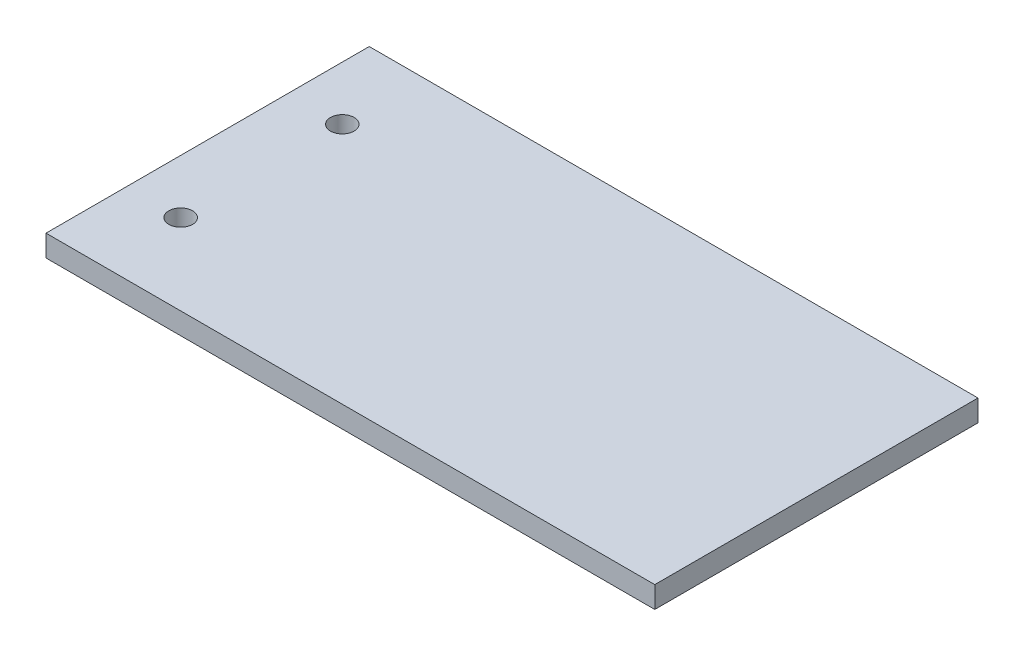
ISO-10303-21;
HEADER;
FILE_DESCRIPTION(('STEP AP214'),'2;1');
FILE_NAME('part.step','',(''),(''),'','','');
FILE_SCHEMA(('AUTOMOTIVE_DESIGN { 1 0 10303 214 1 1 1 1 }'));
ENDSEC;
DATA;
#1=APPLICATION_CONTEXT('core data for automotive mechanical design processes');
#2=APPLICATION_PROTOCOL_DEFINITION('international standard','automotive_design',2000,#1);
#3=PRODUCT_CONTEXT('',#1,'mechanical');
#4=PRODUCT('Part','Part','',(#3));
#5=PRODUCT_RELATED_PRODUCT_CATEGORY('part','',(#4));
#6=PRODUCT_DEFINITION_FORMATION('','',#4);
#7=PRODUCT_DEFINITION_CONTEXT('part definition',#1,'design');
#8=PRODUCT_DEFINITION('design','',#6,#7);
#9=PRODUCT_DEFINITION_SHAPE('','',#8);
#10=(LENGTH_UNIT() NAMED_UNIT(*) SI_UNIT(.MILLI.,.METRE.));
#11=(NAMED_UNIT(*) PLANE_ANGLE_UNIT() SI_UNIT($,.RADIAN.));
#12=(NAMED_UNIT(*) SI_UNIT($,.STERADIAN.) SOLID_ANGLE_UNIT());
#13=UNCERTAINTY_MEASURE_WITH_UNIT(LENGTH_MEASURE(1.E-05),#10,'distance_accuracy_value','');
#14=(GEOMETRIC_REPRESENTATION_CONTEXT(3) GLOBAL_UNCERTAINTY_ASSIGNED_CONTEXT((#13)) GLOBAL_UNIT_ASSIGNED_CONTEXT((#10,
#11,#12)) REPRESENTATION_CONTEXT('',''));
#15=CARTESIAN_POINT('',(0.,0.,0.));
#16=DIRECTION('',(0.,0.,1.));
#17=DIRECTION('',(1.,0.,0.));
#18=AXIS2_PLACEMENT_3D('',#15,#16,#17);
#19=CARTESIAN_POINT('',(0.,4.,0.));
#20=DIRECTION('',(0.,1.,0.));
#21=DIRECTION('',(0.,0.,1.));
#22=AXIS2_PLACEMENT_3D('',#19,#20,#21);
#23=PLANE('',#22);
#24=CARTESIAN_POINT('',(10.,4.,15.));
#25=DIRECTION('',(0.,1.,0.));
#26=DIRECTION('',(0.,0.,1.));
#27=AXIS2_PLACEMENT_3D('',#24,#25,#26);
#28=CIRCLE('',#27,2.2);
#29=CARTESIAN_POINT('',(10.,4.,17.2));
#30=VERTEX_POINT('',#29);
#31=EDGE_CURVE('E103',#30,#30,#28,.T.);
#32=ORIENTED_EDGE('',*,*,#31,.F.);
#33=EDGE_LOOP('',(#32));
#34=FACE_BOUND('',#33,.T.);
#35=DIRECTION('',(0.,0.,1.));
#36=VECTOR('',#35,1.);
#37=CARTESIAN_POINT('',(0.,4.,-30.));
#38=LINE('',#37,#36);
#39=CARTESIAN_POINT('',(0.,4.,-30.));
#40=VERTEX_POINT('',#39);
#41=CARTESIAN_POINT('',(0.,4.,30.));
#42=VERTEX_POINT('',#41);
#43=EDGE_CURVE('E88',#40,#42,#38,.T.);
#44=ORIENTED_EDGE('',*,*,#43,.T.);
#45=DIRECTION('',(1.,0.,0.));
#46=VECTOR('',#45,1.);
#47=CARTESIAN_POINT('',(0.,4.,30.));
#48=LINE('',#47,#46);
#49=CARTESIAN_POINT('',(113.,4.,30.));
#50=VERTEX_POINT('',#49);
#51=EDGE_CURVE('E83',#42,#50,#48,.T.);
#52=ORIENTED_EDGE('',*,*,#51,.T.);
#53=DIRECTION('',(0.,0.,-1.));
#54=VECTOR('',#53,1.);
#55=CARTESIAN_POINT('',(113.,4.,-30.));
#56=LINE('',#55,#54);
#57=CARTESIAN_POINT('',(113.,4.,-30.));
#58=VERTEX_POINT('',#57);
#59=EDGE_CURVE('E86',#50,#58,#56,.T.);
#60=ORIENTED_EDGE('',*,*,#59,.T.);
#61=DIRECTION('',(-1.,0.,0.));
#62=VECTOR('',#61,1.);
#63=CARTESIAN_POINT('',(0.,4.,-30.));
#64=LINE('',#63,#62);
#65=EDGE_CURVE('E53',#58,#40,#64,.T.);
#66=ORIENTED_EDGE('',*,*,#65,.T.);
#67=EDGE_LOOP('',(#44,#52,#60,#66));
#68=FACE_BOUND('',#67,.T.);
#69=CARTESIAN_POINT('',(10.,4.,-15.));
#70=DIRECTION('',(0.,1.,0.));
#71=DIRECTION('',(0.,0.,1.));
#72=AXIS2_PLACEMENT_3D('',#69,#70,#71);
#73=CIRCLE('',#72,2.2);
#74=CARTESIAN_POINT('',(10.,4.,-12.8));
#75=VERTEX_POINT('',#74);
#76=EDGE_CURVE('E118',#75,#75,#73,.T.);
#77=ORIENTED_EDGE('',*,*,#76,.F.);
#78=EDGE_LOOP('',(#77));
#79=FACE_BOUND('',#78,.T.);
#80=ADVANCED_FACE('F36',(#34,#68,#79),#23,.T.);
#81=CARTESIAN_POINT('',(0.,0.,0.));
#82=DIRECTION('',(0.,1.,0.));
#83=DIRECTION('',(0.,0.,1.));
#84=AXIS2_PLACEMENT_3D('',#81,#82,#83);
#85=PLANE('',#84);
#86=DIRECTION('',(0.,0.,1.));
#87=VECTOR('',#86,1.);
#88=CARTESIAN_POINT('',(0.,0.,-30.));
#89=LINE('',#88,#87);
#90=CARTESIAN_POINT('',(0.,0.,-30.));
#91=VERTEX_POINT('',#90);
#92=CARTESIAN_POINT('',(0.,0.,30.));
#93=VERTEX_POINT('',#92);
#94=EDGE_CURVE('E100',#91,#93,#89,.T.);
#95=ORIENTED_EDGE('',*,*,#94,.F.);
#96=DIRECTION('',(-1.,0.,0.));
#97=VECTOR('',#96,1.);
#98=CARTESIAN_POINT('',(0.,0.,-30.));
#99=LINE('',#98,#97);
#100=CARTESIAN_POINT('',(113.,0.,-30.));
#101=VERTEX_POINT('',#100);
#102=EDGE_CURVE('E76',#101,#91,#99,.T.);
#103=ORIENTED_EDGE('',*,*,#102,.F.);
#104=DIRECTION('',(0.,0.,-1.));
#105=VECTOR('',#104,1.);
#106=CARTESIAN_POINT('',(113.,0.,-30.));
#107=LINE('',#106,#105);
#108=CARTESIAN_POINT('',(113.,0.,30.));
#109=VERTEX_POINT('',#108);
#110=EDGE_CURVE('E70',#109,#101,#107,.T.);
#111=ORIENTED_EDGE('',*,*,#110,.F.);
#112=DIRECTION('',(1.,0.,0.));
#113=VECTOR('',#112,1.);
#114=CARTESIAN_POINT('',(0.,0.,30.));
#115=LINE('',#114,#113);
#116=EDGE_CURVE('E92',#93,#109,#115,.T.);
#117=ORIENTED_EDGE('',*,*,#116,.F.);
#118=EDGE_LOOP('',(#95,#103,#111,#117));
#119=FACE_BOUND('',#118,.T.);
#120=CARTESIAN_POINT('',(10.,0.,15.));
#121=DIRECTION('',(0.,1.,0.));
#122=DIRECTION('',(0.,0.,1.));
#123=AXIS2_PLACEMENT_3D('',#120,#121,#122);
#124=CIRCLE('',#123,2.2);
#125=CARTESIAN_POINT('',(10.,0.,17.2));
#126=VERTEX_POINT('',#125);
#127=EDGE_CURVE('E115',#126,#126,#124,.T.);
#128=ORIENTED_EDGE('',*,*,#127,.T.);
#129=EDGE_LOOP('',(#128));
#130=FACE_BOUND('',#129,.T.);
#131=CARTESIAN_POINT('',(10.,0.,-15.));
#132=DIRECTION('',(0.,1.,0.));
#133=DIRECTION('',(0.,0.,1.));
#134=AXIS2_PLACEMENT_3D('',#131,#132,#133);
#135=CIRCLE('',#134,2.2);
#136=CARTESIAN_POINT('',(10.,0.,-12.8));
#137=VERTEX_POINT('',#136);
#138=EDGE_CURVE('E121',#137,#137,#135,.T.);
#139=ORIENTED_EDGE('',*,*,#138,.T.);
#140=EDGE_LOOP('',(#139));
#141=FACE_BOUND('',#140,.T.);
#142=ADVANCED_FACE('F111',(#119,#130,#141),#85,.F.);
#143=CARTESIAN_POINT('',(0.,4.,-30.));
#144=DIRECTION('',(1.,0.,0.));
#145=DIRECTION('',(0.,0.,-1.));
#146=AXIS2_PLACEMENT_3D('',#143,#144,#145);
#147=PLANE('',#146);
#148=ORIENTED_EDGE('',*,*,#94,.T.);
#149=DIRECTION('',(0.,-1.,0.));
#150=VECTOR('',#149,1.);
#151=CARTESIAN_POINT('',(0.,4.,30.));
#152=LINE('',#151,#150);
#153=EDGE_CURVE('E11',#42,#93,#152,.T.);
#154=ORIENTED_EDGE('',*,*,#153,.F.);
#155=ORIENTED_EDGE('',*,*,#43,.F.);
#156=DIRECTION('',(0.,-1.,0.));
#157=VECTOR('',#156,1.);
#158=CARTESIAN_POINT('',(0.,4.,-30.));
#159=LINE('',#158,#157);
#160=EDGE_CURVE('E96',#40,#91,#159,.T.);
#161=ORIENTED_EDGE('',*,*,#160,.T.);
#162=EDGE_LOOP('',(#148,#154,#155,#161));
#163=FACE_BOUND('',#162,.T.);
#164=ADVANCED_FACE('F38',(#163),#147,.F.);
#165=CARTESIAN_POINT('',(0.,4.,30.));
#166=DIRECTION('',(0.,0.,-1.));
#167=DIRECTION('',(-1.,0.,0.));
#168=AXIS2_PLACEMENT_3D('',#165,#166,#167);
#169=PLANE('',#168);
#170=ORIENTED_EDGE('',*,*,#116,.T.);
#171=DIRECTION('',(0.,-1.,0.));
#172=VECTOR('',#171,1.);
#173=CARTESIAN_POINT('',(113.,4.,30.));
#174=LINE('',#173,#172);
#175=EDGE_CURVE('E45',#50,#109,#174,.T.);
#176=ORIENTED_EDGE('',*,*,#175,.F.);
#177=ORIENTED_EDGE('',*,*,#51,.F.);
#178=ORIENTED_EDGE('',*,*,#153,.T.);
#179=EDGE_LOOP('',(#170,#176,#177,#178));
#180=FACE_BOUND('',#179,.T.);
#181=ADVANCED_FACE('F91',(#180),#169,.F.);
#182=CARTESIAN_POINT('',(113.,4.,-30.));
#183=DIRECTION('',(-1.,0.,0.));
#184=DIRECTION('',(0.,0.,1.));
#185=AXIS2_PLACEMENT_3D('',#182,#183,#184);
#186=PLANE('',#185);
#187=ORIENTED_EDGE('',*,*,#110,.T.);
#188=DIRECTION('',(0.,-1.,0.));
#189=VECTOR('',#188,1.);
#190=CARTESIAN_POINT('',(113.,4.,-30.));
#191=LINE('',#190,#189);
#192=EDGE_CURVE('E93',#58,#101,#191,.T.);
#193=ORIENTED_EDGE('',*,*,#192,.F.);
#194=ORIENTED_EDGE('',*,*,#59,.F.);
#195=ORIENTED_EDGE('',*,*,#175,.T.);
#196=EDGE_LOOP('',(#187,#193,#194,#195));
#197=FACE_BOUND('',#196,.T.);
#198=ADVANCED_FACE('F94',(#197),#186,.F.);
#199=CARTESIAN_POINT('',(0.,4.,-30.));
#200=DIRECTION('',(0.,0.,1.));
#201=DIRECTION('',(1.,0.,0.));
#202=AXIS2_PLACEMENT_3D('',#199,#200,#201);
#203=PLANE('',#202);
#204=ORIENTED_EDGE('',*,*,#102,.T.);
#205=ORIENTED_EDGE('',*,*,#160,.F.);
#206=ORIENTED_EDGE('',*,*,#65,.F.);
#207=ORIENTED_EDGE('',*,*,#192,.T.);
#208=EDGE_LOOP('',(#204,#205,#206,#207));
#209=FACE_BOUND('',#208,.T.);
#210=ADVANCED_FACE('F108',(#209),#203,.F.);
#211=CARTESIAN_POINT('',(10.,4.,15.));
#212=DIRECTION('',(0.,-1.,0.));
#213=DIRECTION('',(0.,0.,-1.));
#214=AXIS2_PLACEMENT_3D('',#211,#212,#213);
#215=CYLINDRICAL_SURFACE('',#214,2.2);
#216=ORIENTED_EDGE('',*,*,#31,.T.);
#217=EDGE_LOOP('',(#216));
#218=FACE_BOUND('',#217,.T.);
#219=ORIENTED_EDGE('',*,*,#127,.F.);
#220=EDGE_LOOP('',(#219));
#221=FACE_BOUND('',#220,.T.);
#222=ADVANCED_FACE('F138',(#218,#221),#215,.F.);
#223=CARTESIAN_POINT('',(10.,4.,-15.));
#224=DIRECTION('',(0.,-1.,0.));
#225=DIRECTION('',(0.,0.,-1.));
#226=AXIS2_PLACEMENT_3D('',#223,#224,#225);
#227=CYLINDRICAL_SURFACE('',#226,2.2);
#228=ORIENTED_EDGE('',*,*,#76,.T.);
#229=EDGE_LOOP('',(#228));
#230=FACE_BOUND('',#229,.T.);
#231=ORIENTED_EDGE('',*,*,#138,.F.);
#232=EDGE_LOOP('',(#231));
#233=FACE_BOUND('',#232,.T.);
#234=ADVANCED_FACE('F127',(#230,#233),#227,.F.);
#235=CLOSED_SHELL('',(#80,#142,#164,#181,#198,#210,#222,#234));
#236=MANIFOLD_SOLID_BREP('B2',#235);
#237=ADVANCED_BREP_SHAPE_REPRESENTATION('',(#18,#236),#14);
#238=SHAPE_DEFINITION_REPRESENTATION(#9,#237);
ENDSEC;
END-ISO-10303-21;
